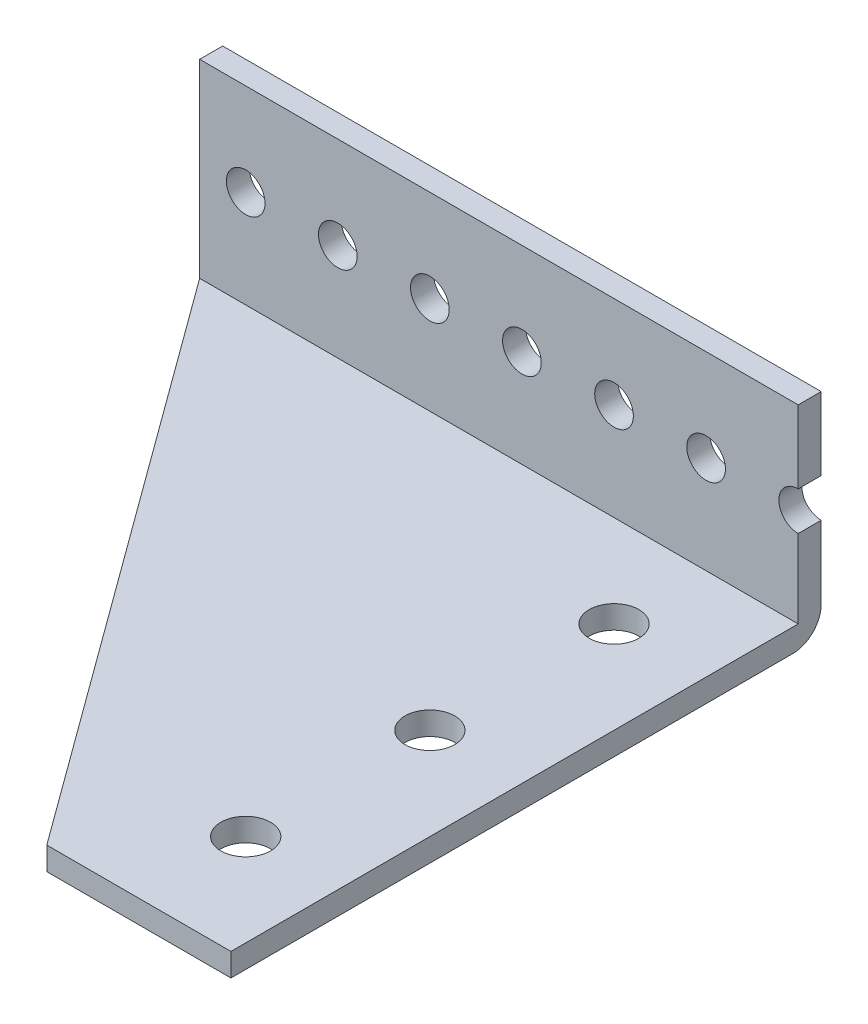
ISO-10303-21;
HEADER;
FILE_DESCRIPTION(('STEP AP214'),'2;1');
FILE_NAME('part.step','',(''),(''),'','','');
FILE_SCHEMA(('AUTOMOTIVE_DESIGN { 1 0 10303 214 1 1 1 1 }'));
ENDSEC;
DATA;
#1=APPLICATION_CONTEXT('core data for automotive mechanical design processes');
#2=APPLICATION_PROTOCOL_DEFINITION('international standard','automotive_design',2000,#1);
#3=PRODUCT_CONTEXT('',#1,'mechanical');
#4=PRODUCT('Part','Part','',(#3));
#5=PRODUCT_RELATED_PRODUCT_CATEGORY('part','',(#4));
#6=PRODUCT_DEFINITION_FORMATION('','',#4);
#7=PRODUCT_DEFINITION_CONTEXT('part definition',#1,'design');
#8=PRODUCT_DEFINITION('design','',#6,#7);
#9=PRODUCT_DEFINITION_SHAPE('','',#8);
#10=(LENGTH_UNIT() NAMED_UNIT(*) SI_UNIT(.MILLI.,.METRE.));
#11=(NAMED_UNIT(*) PLANE_ANGLE_UNIT() SI_UNIT($,.RADIAN.));
#12=(NAMED_UNIT(*) SI_UNIT($,.STERADIAN.) SOLID_ANGLE_UNIT());
#13=UNCERTAINTY_MEASURE_WITH_UNIT(LENGTH_MEASURE(1.E-05),#10,'distance_accuracy_value','');
#14=(GEOMETRIC_REPRESENTATION_CONTEXT(3) GLOBAL_UNCERTAINTY_ASSIGNED_CONTEXT((#13)) GLOBAL_UNIT_ASSIGNED_CONTEXT((#10,
#11,#12)) REPRESENTATION_CONTEXT('',''));
#15=CARTESIAN_POINT('',(0.,0.,0.));
#16=DIRECTION('',(0.,0.,1.));
#17=DIRECTION('',(1.,0.,0.));
#18=AXIS2_PLACEMENT_3D('',#15,#16,#17);
#19=CARTESIAN_POINT('',(41.275,-31.75,-40.7035));
#20=DIRECTION('',(0.,0.,1.));
#21=DIRECTION('',(1.,0.,0.));
#22=AXIS2_PLACEMENT_3D('',#19,#20,#21);
#23=PLANE('',#22);
#24=CARTESIAN_POINT('',(-22.225,-18.2879999999999,-40.7035));
#25=DIRECTION('',(0.,0.,-1.));
#26=DIRECTION('',(-1.,0.,0.));
#27=AXIS2_PLACEMENT_3D('',#24,#25,#26);
#28=CIRCLE('',#27,2.66699999999999);
#29=CARTESIAN_POINT('',(-24.892,-18.2879999999999,-40.7035));
#30=VERTEX_POINT('',#29);
#31=EDGE_CURVE('E259',#30,#30,#28,.T.);
#32=ORIENTED_EDGE('',*,*,#31,.F.);
#33=EDGE_LOOP('',(#32));
#34=FACE_BOUND('',#33,.T.);
#35=CARTESIAN_POINT('',(-9.52499999999998,-18.2879999999999,-40.7035));
#36=DIRECTION('',(0.,0.,-1.));
#37=DIRECTION('',(-1.,0.,0.));
#38=AXIS2_PLACEMENT_3D('',#35,#36,#37);
#39=CIRCLE('',#38,2.66699999999998);
#40=CARTESIAN_POINT('',(-12.192,-18.2879999999999,-40.7035));
#41=VERTEX_POINT('',#40);
#42=EDGE_CURVE('E166',#41,#41,#39,.T.);
#43=ORIENTED_EDGE('',*,*,#42,.F.);
#44=EDGE_LOOP('',(#43));
#45=FACE_BOUND('',#44,.T.);
#46=CARTESIAN_POINT('',(3.17500000000006,-18.2879999999999,-40.7035));
#47=DIRECTION('',(0.,0.,-1.));
#48=DIRECTION('',(-1.,0.,0.));
#49=AXIS2_PLACEMENT_3D('',#46,#47,#48);
#50=CIRCLE('',#49,2.66699999999998);
#51=CARTESIAN_POINT('',(0.508000000000076,-18.2879999999999,-40.7035));
#52=VERTEX_POINT('',#51);
#53=EDGE_CURVE('E162',#52,#52,#50,.T.);
#54=ORIENTED_EDGE('',*,*,#53,.F.);
#55=EDGE_LOOP('',(#54));
#56=FACE_BOUND('',#55,.T.);
#57=CARTESIAN_POINT('',(15.8750000000001,-18.2879999999999,-40.7035));
#58=DIRECTION('',(0.,0.,-1.));
#59=DIRECTION('',(-1.,0.,0.));
#60=AXIS2_PLACEMENT_3D('',#57,#58,#59);
#61=CIRCLE('',#60,2.66699999999998);
#62=CARTESIAN_POINT('',(13.2080000000001,-18.2879999999999,-40.7035));
#63=VERTEX_POINT('',#62);
#64=EDGE_CURVE('E158',#63,#63,#61,.T.);
#65=ORIENTED_EDGE('',*,*,#64,.F.);
#66=EDGE_LOOP('',(#65));
#67=FACE_BOUND('',#66,.T.);
#68=CARTESIAN_POINT('',(28.5750000000001,-18.2879999999999,-40.7035));
#69=DIRECTION('',(0.,0.,-1.));
#70=DIRECTION('',(-1.,0.,0.));
#71=AXIS2_PLACEMENT_3D('',#68,#69,#70);
#72=CIRCLE('',#71,2.66699999999998);
#73=CARTESIAN_POINT('',(25.9080000000001,-18.2879999999999,-40.7035));
#74=VERTEX_POINT('',#73);
#75=EDGE_CURVE('E157',#74,#74,#72,.T.);
#76=ORIENTED_EDGE('',*,*,#75,.F.);
#77=EDGE_LOOP('',(#76));
#78=FACE_BOUND('',#77,.T.);
#79=CARTESIAN_POINT('',(-34.925,-18.2879999999999,-40.7035));
#80=DIRECTION('',(0.,0.,-1.));
#81=DIRECTION('',(-1.,0.,0.));
#82=AXIS2_PLACEMENT_3D('',#79,#80,#81);
#83=CIRCLE('',#82,2.66699999999998);
#84=CARTESIAN_POINT('',(-37.592,-18.2879999999999,-40.7035));
#85=VERTEX_POINT('',#84);
#86=EDGE_CURVE('E204',#85,#85,#83,.T.);
#87=ORIENTED_EDGE('',*,*,#86,.F.);
#88=EDGE_LOOP('',(#87));
#89=FACE_BOUND('',#88,.T.);
#90=DIRECTION('',(0.,-1.,0.));
#91=VECTOR('',#90,1.);
#92=CARTESIAN_POINT('',(-41.275,-31.75,-40.7035));
#93=LINE('',#92,#91);
#94=CARTESIAN_POINT('',(-41.275,-5.58799999999996,-40.7035));
#95=VERTEX_POINT('',#94);
#96=CARTESIAN_POINT('',(-41.275,-30.988,-40.7035));
#97=VERTEX_POINT('',#96);
#98=EDGE_CURVE('E134',#95,#97,#93,.T.);
#99=ORIENTED_EDGE('',*,*,#98,.F.);
#100=DIRECTION('',(-1.,0.,0.));
#101=VECTOR('',#100,1.);
#102=CARTESIAN_POINT('',(41.275,-5.58799999999996,-40.7035));
#103=LINE('',#102,#101);
#104=CARTESIAN_POINT('',(41.275,-5.58799999999996,-40.7035));
#105=VERTEX_POINT('',#104);
#106=EDGE_CURVE('E123',#105,#95,#103,.T.);
#107=ORIENTED_EDGE('',*,*,#106,.F.);
#108=DIRECTION('',(0.,-1.,0.));
#109=VECTOR('',#108,1.);
#110=CARTESIAN_POINT('',(41.275,-31.75,-40.7035));
#111=LINE('',#110,#109);
#112=CARTESIAN_POINT('',(41.275,-15.621,-40.7035));
#113=VERTEX_POINT('',#112);
#114=EDGE_CURVE('E131',#105,#113,#111,.T.);
#115=ORIENTED_EDGE('',*,*,#114,.T.);
#116=CARTESIAN_POINT('',(41.275,-18.2879999999999,-40.7035));
#117=DIRECTION('',(0.,0.,-1.));
#118=DIRECTION('',(-1.,0.,0.));
#119=AXIS2_PLACEMENT_3D('',#116,#117,#118);
#120=CIRCLE('',#119,2.66699999999998);
#121=CARTESIAN_POINT('',(41.275,-20.9549999999999,-40.7035));
#122=VERTEX_POINT('',#121);
#123=EDGE_CURVE('E195',#122,#113,#120,.T.);
#124=ORIENTED_EDGE('',*,*,#123,.F.);
#125=CARTESIAN_POINT('',(41.275,-30.988,-40.7035));
#126=VERTEX_POINT('',#125);
#127=EDGE_CURVE('E141',#122,#126,#111,.T.);
#128=ORIENTED_EDGE('',*,*,#127,.T.);
#129=DIRECTION('',(-1.,0.,0.));
#130=VECTOR('',#129,1.);
#131=CARTESIAN_POINT('',(41.275,-30.988,-40.7035));
#132=LINE('',#131,#130);
#133=EDGE_CURVE('E153',#126,#97,#132,.T.);
#134=ORIENTED_EDGE('',*,*,#133,.T.);
#135=EDGE_LOOP('',(#99,#107,#115,#124,#128,#134));
#136=FACE_BOUND('',#135,.T.);
#137=ADVANCED_FACE('F48',(#34,#45,#56,#67,#78,#89,#136),#23,.F.);
#138=CARTESIAN_POINT('',(41.275,-31.75,40.7035));
#139=DIRECTION('',(-1.,0.,0.));
#140=DIRECTION('',(0.,0.,1.));
#141=AXIS2_PLACEMENT_3D('',#138,#139,#140);
#142=PLANE('',#141);
#143=ORIENTED_EDGE('',*,*,#114,.F.);
#144=DIRECTION('',(0.,0.,-1.));
#145=VECTOR('',#144,1.);
#146=CARTESIAN_POINT('',(41.275,-5.58799999999996,40.7035));
#147=LINE('',#146,#145);
#148=CARTESIAN_POINT('',(41.275,-5.58799999999996,-37.5284999999999));
#149=VERTEX_POINT('',#148);
#150=EDGE_CURVE('E120',#149,#105,#147,.T.);
#151=ORIENTED_EDGE('',*,*,#150,.F.);
#152=DIRECTION('',(0.,-1.,0.));
#153=VECTOR('',#152,1.);
#154=CARTESIAN_POINT('',(41.275,19.05,-37.5284999999999));
#155=LINE('',#154,#153);
#156=CARTESIAN_POINT('',(41.275,-15.621,-37.5284999999999));
#157=VERTEX_POINT('',#156);
#158=EDGE_CURVE('E211',#149,#157,#155,.T.);
#159=ORIENTED_EDGE('',*,*,#158,.T.);
#160=DIRECTION('',(0.,0.,-1.));
#161=VECTOR('',#160,1.);
#162=CARTESIAN_POINT('',(41.275,-15.621,-40.7035));
#163=LINE('',#162,#161);
#164=EDGE_CURVE('E139',#157,#113,#163,.T.);
#165=ORIENTED_EDGE('',*,*,#164,.T.);
#166=EDGE_LOOP('',(#143,#151,#159,#165));
#167=FACE_BOUND('',#166,.T.);
#168=ADVANCED_FACE('F137',(#167),#142,.F.);
#169=CARTESIAN_POINT('',(-41.275,-31.75,40.7035));
#170=DIRECTION('',(0.,0.,-1.));
#171=DIRECTION('',(-1.,0.,0.));
#172=AXIS2_PLACEMENT_3D('',#169,#170,#171);
#173=PLANE('',#172);
#174=DIRECTION('',(1.,0.,0.));
#175=VECTOR('',#174,1.);
#176=CARTESIAN_POINT('',(-41.275,-31.75,40.7035));
#177=LINE('',#176,#175);
#178=CARTESIAN_POINT('',(15.875,-31.75,40.7035));
#179=VERTEX_POINT('',#178);
#180=CARTESIAN_POINT('',(41.275,-31.75,40.7035));
#181=VERTEX_POINT('',#180);
#182=EDGE_CURVE('E215',#179,#181,#177,.T.);
#183=ORIENTED_EDGE('',*,*,#182,.F.);
#184=DIRECTION('',(0.,-1.,0.));
#185=VECTOR('',#184,1.);
#186=CARTESIAN_POINT('',(15.875,19.05,40.7035));
#187=LINE('',#186,#185);
#188=CARTESIAN_POINT('',(15.875,-34.925,40.7035));
#189=VERTEX_POINT('',#188);
#190=EDGE_CURVE('E224',#179,#189,#187,.T.);
#191=ORIENTED_EDGE('',*,*,#190,.T.);
#192=DIRECTION('',(1.,0.,0.));
#193=VECTOR('',#192,1.);
#194=CARTESIAN_POINT('',(-41.275,-34.925,40.7035));
#195=LINE('',#194,#193);
#196=CARTESIAN_POINT('',(41.275,-34.925,40.7035));
#197=VERTEX_POINT('',#196);
#198=EDGE_CURVE('E186',#189,#197,#195,.T.);
#199=ORIENTED_EDGE('',*,*,#198,.T.);
#200=DIRECTION('',(0.,-1.,0.));
#201=VECTOR('',#200,1.);
#202=CARTESIAN_POINT('',(41.275,-31.75,40.7035));
#203=LINE('',#202,#201);
#204=EDGE_CURVE('E140',#181,#197,#203,.T.);
#205=ORIENTED_EDGE('',*,*,#204,.F.);
#206=EDGE_LOOP('',(#183,#191,#199,#205));
#207=FACE_BOUND('',#206,.T.);
#208=ADVANCED_FACE('F223',(#207),#173,.F.);
#209=DIRECTION('',(0.,0.,-1.));
#210=VECTOR('',#209,1.);
#211=CARTESIAN_POINT('',(41.275,-34.925,40.7035));
#212=LINE('',#211,#210);
#213=CARTESIAN_POINT('',(41.275,-34.925,-36.7665));
#214=VERTEX_POINT('',#213);
#215=EDGE_CURVE('E194',#197,#214,#212,.T.);
#216=ORIENTED_EDGE('',*,*,#215,.T.);
#217=CARTESIAN_POINT('',(41.275,-30.988,-36.7665));
#218=DIRECTION('',(-1.,0.,0.));
#219=DIRECTION('',(0.,0.,1.));
#220=AXIS2_PLACEMENT_3D('',#217,#218,#219);
#221=CIRCLE('',#220,3.937);
#222=EDGE_CURVE('E173',#214,#126,#221,.F.);
#223=ORIENTED_EDGE('',*,*,#222,.T.);
#224=ORIENTED_EDGE('',*,*,#127,.F.);
#225=DIRECTION('',(0.,0.,-1.));
#226=VECTOR('',#225,1.);
#227=CARTESIAN_POINT('',(41.275,-20.9549999999999,-40.7035));
#228=LINE('',#227,#226);
#229=CARTESIAN_POINT('',(41.275,-20.9549999999999,-37.5284999999999));
#230=VERTEX_POINT('',#229);
#231=EDGE_CURVE('E144',#122,#230,#228,.F.);
#232=ORIENTED_EDGE('',*,*,#231,.T.);
#233=CARTESIAN_POINT('',(41.275,-31.75,-37.5284999999999));
#234=VERTEX_POINT('',#233);
#235=EDGE_CURVE('E210',#230,#234,#155,.T.);
#236=ORIENTED_EDGE('',*,*,#235,.T.);
#237=DIRECTION('',(0.,0.,-1.));
#238=VECTOR('',#237,1.);
#239=CARTESIAN_POINT('',(41.275,-31.75,40.7035));
#240=LINE('',#239,#238);
#241=EDGE_CURVE('E217',#181,#234,#240,.T.);
#242=ORIENTED_EDGE('',*,*,#241,.F.);
#243=ORIENTED_EDGE('',*,*,#204,.T.);
#244=EDGE_LOOP('',(#216,#223,#224,#232,#236,#242,#243));
#245=FACE_BOUND('',#244,.T.);
#246=ADVANCED_FACE('F193',(#245),#142,.F.);
#247=CARTESIAN_POINT('',(-41.275,-31.75,40.7035));
#248=DIRECTION('',(1.,0.,0.));
#249=DIRECTION('',(0.,0.,-1.));
#250=AXIS2_PLACEMENT_3D('',#247,#248,#249);
#251=PLANE('',#250);
#252=DIRECTION('',(0.,-1.,0.));
#253=VECTOR('',#252,1.);
#254=CARTESIAN_POINT('',(-41.275,19.05,-37.5284999999999));
#255=LINE('',#254,#253);
#256=CARTESIAN_POINT('',(-41.275,-5.58799999999996,-37.5284999999999));
#257=VERTEX_POINT('',#256);
#258=CARTESIAN_POINT('',(-41.275,-31.75,-37.5284999999999));
#259=VERTEX_POINT('',#258);
#260=EDGE_CURVE('E213',#257,#259,#255,.T.);
#261=ORIENTED_EDGE('',*,*,#260,.F.);
#262=DIRECTION('',(0.,0.,-1.));
#263=VECTOR('',#262,1.);
#264=CARTESIAN_POINT('',(-41.275,-5.58799999999996,40.7035));
#265=LINE('',#264,#263);
#266=EDGE_CURVE('E63',#257,#95,#265,.T.);
#267=ORIENTED_EDGE('',*,*,#266,.T.);
#268=ORIENTED_EDGE('',*,*,#98,.T.);
#269=CARTESIAN_POINT('',(-41.275,-30.988,-36.7665));
#270=DIRECTION('',(1.,0.,0.));
#271=DIRECTION('',(0.,0.,-1.));
#272=AXIS2_PLACEMENT_3D('',#269,#270,#271);
#273=CIRCLE('',#272,3.937);
#274=CARTESIAN_POINT('',(-41.275,-34.8505542067394,-37.5284999999999));
#275=VERTEX_POINT('',#274);
#276=EDGE_CURVE('E168',#97,#275,#273,.F.);
#277=ORIENTED_EDGE('',*,*,#276,.T.);
#278=DIRECTION('',(0.,-1.,0.));
#279=VECTOR('',#278,1.);
#280=CARTESIAN_POINT('',(-41.275,19.05,-37.5284999999999));
#281=LINE('',#280,#279);
#282=EDGE_CURVE('E70',#259,#275,#281,.T.);
#283=ORIENTED_EDGE('',*,*,#282,.F.);
#284=EDGE_LOOP('',(#261,#267,#268,#277,#283));
#285=FACE_BOUND('',#284,.T.);
#286=ADVANCED_FACE('F239',(#285),#251,.F.);
#287=CARTESIAN_POINT('',(0.,-31.75,0.));
#288=DIRECTION('',(0.,1.,0.));
#289=DIRECTION('',(0.,0.,1.));
#290=AXIS2_PLACEMENT_3D('',#287,#288,#289);
#291=PLANE('',#290);
#292=DIRECTION('',(-0.589885116714,0.,-0.807487181990718));
#293=VECTOR('',#292,1.);
#294=CARTESIAN_POINT('',(-9.03701688787469,-31.75,6.601716882376));
#295=LINE('',#294,#293);
#296=EDGE_CURVE('E236',#179,#259,#295,.T.);
#297=ORIENTED_EDGE('',*,*,#296,.F.);
#298=ORIENTED_EDGE('',*,*,#182,.T.);
#299=ORIENTED_EDGE('',*,*,#241,.T.);
#300=DIRECTION('',(1.,0.,0.));
#301=VECTOR('',#300,1.);
#302=CARTESIAN_POINT('',(41.275,-31.75,-37.5284999999999));
#303=LINE('',#302,#301);
#304=EDGE_CURVE('E201',#259,#234,#303,.T.);
#305=ORIENTED_EDGE('',*,*,#304,.F.);
#306=EDGE_LOOP('',(#297,#298,#299,#305));
#307=FACE_BOUND('',#306,.T.);
#308=CARTESIAN_POINT('',(28.575,-31.75,-24.8284999999999));
#309=DIRECTION('',(0.,1.,0.));
#310=DIRECTION('',(0.,0.,1.));
#311=AXIS2_PLACEMENT_3D('',#308,#309,#310);
#312=CIRCLE('',#311,3.42899999999998);
#313=CARTESIAN_POINT('',(28.575,-31.75,-21.3994999999999));
#314=VERTEX_POINT('',#313);
#315=EDGE_CURVE('E256',#314,#314,#312,.T.);
#316=ORIENTED_EDGE('',*,*,#315,.F.);
#317=EDGE_LOOP('',(#316));
#318=FACE_BOUND('',#317,.T.);
#319=CARTESIAN_POINT('',(28.5749999999997,-31.75,0.571500000000131));
#320=DIRECTION('',(0.,1.,0.));
#321=DIRECTION('',(0.,0.,1.));
#322=AXIS2_PLACEMENT_3D('',#319,#320,#321);
#323=CIRCLE('',#322,3.42899999999998);
#324=CARTESIAN_POINT('',(28.5749999999997,-31.75,4.00050000000011));
#325=VERTEX_POINT('',#324);
#326=EDGE_CURVE('E253',#325,#325,#323,.T.);
#327=ORIENTED_EDGE('',*,*,#326,.F.);
#328=EDGE_LOOP('',(#327));
#329=FACE_BOUND('',#328,.T.);
#330=CARTESIAN_POINT('',(28.5749999999995,-31.75,25.9715000000001));
#331=DIRECTION('',(0.,1.,0.));
#332=DIRECTION('',(0.,0.,1.));
#333=AXIS2_PLACEMENT_3D('',#330,#331,#332);
#334=CIRCLE('',#333,3.42899999999998);
#335=CARTESIAN_POINT('',(28.5749999999995,-31.75,29.4005000000001));
#336=VERTEX_POINT('',#335);
#337=EDGE_CURVE('E237',#336,#336,#334,.T.);
#338=ORIENTED_EDGE('',*,*,#337,.F.);
#339=EDGE_LOOP('',(#338));
#340=FACE_BOUND('',#339,.T.);
#341=ADVANCED_FACE('F230',(#307,#318,#329,#340),#291,.T.);
#342=CARTESIAN_POINT('',(0.,-34.925,0.));
#343=DIRECTION('',(0.,1.,0.));
#344=DIRECTION('',(0.,0.,1.));
#345=AXIS2_PLACEMENT_3D('',#342,#343,#344);
#346=PLANE('',#345);
#347=CARTESIAN_POINT('',(28.575,-34.925,-24.8284999999999));
#348=DIRECTION('',(0.,-1.,0.));
#349=DIRECTION('',(0.,0.,-1.));
#350=AXIS2_PLACEMENT_3D('',#347,#348,#349);
#351=CIRCLE('',#350,3.42899999999998);
#352=CARTESIAN_POINT('',(28.575,-34.925,-28.2574999999998));
#353=VERTEX_POINT('',#352);
#354=EDGE_CURVE('E187',#353,#353,#351,.T.);
#355=ORIENTED_EDGE('',*,*,#354,.F.);
#356=EDGE_LOOP('',(#355));
#357=FACE_BOUND('',#356,.T.);
#358=CARTESIAN_POINT('',(28.5749999999997,-34.925,0.571500000000131));
#359=DIRECTION('',(0.,-1.,0.));
#360=DIRECTION('',(0.,0.,-1.));
#361=AXIS2_PLACEMENT_3D('',#358,#359,#360);
#362=CIRCLE('',#361,3.42899999999998);
#363=CARTESIAN_POINT('',(28.5749999999997,-34.925,-2.85749999999985));
#364=VERTEX_POINT('',#363);
#365=EDGE_CURVE('E245',#364,#364,#362,.T.);
#366=ORIENTED_EDGE('',*,*,#365,.F.);
#367=EDGE_LOOP('',(#366));
#368=FACE_BOUND('',#367,.T.);
#369=CARTESIAN_POINT('',(28.5749999999995,-34.925,25.9715000000001));
#370=DIRECTION('',(0.,-1.,0.));
#371=DIRECTION('',(0.,0.,-1.));
#372=AXIS2_PLACEMENT_3D('',#369,#370,#371);
#373=CIRCLE('',#372,3.42899999999998);
#374=CARTESIAN_POINT('',(28.5749999999995,-34.925,22.5425000000001));
#375=VERTEX_POINT('',#374);
#376=EDGE_CURVE('E248',#375,#375,#373,.T.);
#377=ORIENTED_EDGE('',*,*,#376,.F.);
#378=EDGE_LOOP('',(#377));
#379=FACE_BOUND('',#378,.T.);
#380=ORIENTED_EDGE('',*,*,#198,.F.);
#381=DIRECTION('',(0.589885116714,0.,0.807487181990718));
#382=VECTOR('',#381,1.);
#383=CARTESIAN_POINT('',(-41.275,-34.925,-37.5284999999999));
#384=LINE('',#383,#382);
#385=CARTESIAN_POINT('',(-40.7183441558442,-34.925,-36.7665));
#386=VERTEX_POINT('',#385);
#387=EDGE_CURVE('E176',#386,#189,#384,.T.);
#388=ORIENTED_EDGE('',*,*,#387,.F.);
#389=DIRECTION('',(-1.,0.,0.));
#390=VECTOR('',#389,1.);
#391=CARTESIAN_POINT('',(0.,-34.925,-36.7665));
#392=LINE('',#391,#390);
#393=EDGE_CURVE('E171',#386,#214,#392,.F.);
#394=ORIENTED_EDGE('',*,*,#393,.T.);
#395=ORIENTED_EDGE('',*,*,#215,.F.);
#396=EDGE_LOOP('',(#380,#388,#394,#395));
#397=FACE_BOUND('',#396,.T.);
#398=ADVANCED_FACE('F183',(#357,#368,#379,#397),#346,.F.);
#399=CARTESIAN_POINT('',(41.275,19.05,-37.5284999999999));
#400=DIRECTION('',(0.,0.,-1.));
#401=DIRECTION('',(-1.,0.,0.));
#402=AXIS2_PLACEMENT_3D('',#399,#400,#401);
#403=PLANE('',#402);
#404=CARTESIAN_POINT('',(-22.225,-18.2879999999999,-37.5284999999999));
#405=DIRECTION('',(0.,0.,-1.));
#406=DIRECTION('',(-1.,0.,0.));
#407=AXIS2_PLACEMENT_3D('',#404,#405,#406);
#408=CIRCLE('',#407,2.66699999999998);
#409=CARTESIAN_POINT('',(-24.892,-18.2879999999999,-37.5284999999999));
#410=VERTEX_POINT('',#409);
#411=EDGE_CURVE('E262',#410,#410,#408,.T.);
#412=ORIENTED_EDGE('',*,*,#411,.T.);
#413=EDGE_LOOP('',(#412));
#414=FACE_BOUND('',#413,.T.);
#415=CARTESIAN_POINT('',(-9.52499999999998,-18.2879999999999,-37.5284999999999));
#416=DIRECTION('',(0.,0.,-1.));
#417=DIRECTION('',(-1.,0.,0.));
#418=AXIS2_PLACEMENT_3D('',#415,#416,#417);
#419=CIRCLE('',#418,2.66699999999998);
#420=CARTESIAN_POINT('',(-12.192,-18.2879999999999,-37.5284999999999));
#421=VERTEX_POINT('',#420);
#422=EDGE_CURVE('E163',#421,#421,#419,.T.);
#423=ORIENTED_EDGE('',*,*,#422,.T.);
#424=EDGE_LOOP('',(#423));
#425=FACE_BOUND('',#424,.T.);
#426=CARTESIAN_POINT('',(3.17500000000006,-18.2879999999999,-37.5284999999999));
#427=DIRECTION('',(0.,0.,-1.));
#428=DIRECTION('',(-1.,0.,0.));
#429=AXIS2_PLACEMENT_3D('',#426,#427,#428);
#430=CIRCLE('',#429,2.66699999999998);
#431=CARTESIAN_POINT('',(0.50800000000008,-18.2879999999999,-37.5284999999999));
#432=VERTEX_POINT('',#431);
#433=EDGE_CURVE('E159',#432,#432,#430,.T.);
#434=ORIENTED_EDGE('',*,*,#433,.T.);
#435=EDGE_LOOP('',(#434));
#436=FACE_BOUND('',#435,.T.);
#437=CARTESIAN_POINT('',(15.8750000000001,-18.2879999999999,-37.5284999999999));
#438=DIRECTION('',(0.,0.,-1.));
#439=DIRECTION('',(-1.,0.,0.));
#440=AXIS2_PLACEMENT_3D('',#437,#438,#439);
#441=CIRCLE('',#440,2.66699999999998);
#442=CARTESIAN_POINT('',(13.2080000000001,-18.2879999999999,-37.5284999999999));
#443=VERTEX_POINT('',#442);
#444=EDGE_CURVE('E154',#443,#443,#441,.T.);
#445=ORIENTED_EDGE('',*,*,#444,.T.);
#446=EDGE_LOOP('',(#445));
#447=FACE_BOUND('',#446,.T.);
#448=CARTESIAN_POINT('',(28.5750000000001,-18.2879999999999,-37.5284999999999));
#449=DIRECTION('',(0.,0.,-1.));
#450=DIRECTION('',(-1.,0.,0.));
#451=AXIS2_PLACEMENT_3D('',#448,#449,#450);
#452=CIRCLE('',#451,2.66699999999998);
#453=CARTESIAN_POINT('',(25.9080000000001,-18.2879999999999,-37.5284999999999));
#454=VERTEX_POINT('',#453);
#455=EDGE_CURVE('E273',#454,#454,#452,.T.);
#456=ORIENTED_EDGE('',*,*,#455,.T.);
#457=EDGE_LOOP('',(#456));
#458=FACE_BOUND('',#457,.T.);
#459=CARTESIAN_POINT('',(-34.925,-18.2879999999999,-37.5284999999999));
#460=DIRECTION('',(0.,0.,-1.));
#461=DIRECTION('',(-1.,0.,0.));
#462=AXIS2_PLACEMENT_3D('',#459,#460,#461);
#463=CIRCLE('',#462,2.66699999999998);
#464=CARTESIAN_POINT('',(-37.592,-18.2879999999999,-37.5284999999999));
#465=VERTEX_POINT('',#464);
#466=EDGE_CURVE('E198',#465,#465,#463,.T.);
#467=ORIENTED_EDGE('',*,*,#466,.T.);
#468=EDGE_LOOP('',(#467));
#469=FACE_BOUND('',#468,.T.);
#470=ORIENTED_EDGE('',*,*,#158,.F.);
#471=DIRECTION('',(-1.,0.,0.));
#472=VECTOR('',#471,1.);
#473=CARTESIAN_POINT('',(41.275,-5.58799999999996,-37.5284999999999));
#474=LINE('',#473,#472);
#475=EDGE_CURVE('E12',#149,#257,#474,.T.);
#476=ORIENTED_EDGE('',*,*,#475,.T.);
#477=ORIENTED_EDGE('',*,*,#260,.T.);
#478=ORIENTED_EDGE('',*,*,#304,.T.);
#479=ORIENTED_EDGE('',*,*,#235,.F.);
#480=CARTESIAN_POINT('',(41.275,-18.2879999999999,-37.5284999999999));
#481=DIRECTION('',(0.,0.,-1.));
#482=DIRECTION('',(-1.,0.,0.));
#483=AXIS2_PLACEMENT_3D('',#480,#481,#482);
#484=CIRCLE('',#483,2.66699999999998);
#485=EDGE_CURVE('E197',#230,#157,#484,.T.);
#486=ORIENTED_EDGE('',*,*,#485,.T.);
#487=EDGE_LOOP('',(#470,#476,#477,#478,#479,#486));
#488=FACE_BOUND('',#487,.T.);
#489=ADVANCED_FACE('F233',(#414,#425,#436,#447,#458,#469,#488),#403,.F.);
#490=CARTESIAN_POINT('',(41.275,-18.2879999999999,-40.7035));
#491=DIRECTION('',(0.,0.,-1.));
#492=DIRECTION('',(-1.,0.,0.));
#493=AXIS2_PLACEMENT_3D('',#490,#491,#492);
#494=CYLINDRICAL_SURFACE('',#493,2.66699999999998);
#495=ORIENTED_EDGE('',*,*,#485,.F.);
#496=ORIENTED_EDGE('',*,*,#231,.F.);
#497=ORIENTED_EDGE('',*,*,#123,.T.);
#498=ORIENTED_EDGE('',*,*,#164,.F.);
#499=EDGE_LOOP('',(#495,#496,#497,#498));
#500=FACE_BOUND('',#499,.T.);
#501=ADVANCED_FACE('F327',(#500),#494,.F.);
#502=CARTESIAN_POINT('',(-34.925,-18.2879999999999,-40.7035));
#503=DIRECTION('',(0.,0.,-1.));
#504=DIRECTION('',(-1.,0.,0.));
#505=AXIS2_PLACEMENT_3D('',#502,#503,#504);
#506=CYLINDRICAL_SURFACE('',#505,2.66699999999998);
#507=ORIENTED_EDGE('',*,*,#86,.T.);
#508=EDGE_LOOP('',(#507));
#509=FACE_BOUND('',#508,.T.);
#510=ORIENTED_EDGE('',*,*,#466,.F.);
#511=EDGE_LOOP('',(#510));
#512=FACE_BOUND('',#511,.T.);
#513=ADVANCED_FACE('F278',(#509,#512),#506,.F.);
#514=CARTESIAN_POINT('',(28.5750000000001,-18.2879999999999,-40.7035));
#515=DIRECTION('',(0.,0.,-1.));
#516=DIRECTION('',(-1.,0.,0.));
#517=AXIS2_PLACEMENT_3D('',#514,#515,#516);
#518=CYLINDRICAL_SURFACE('',#517,2.66699999999998);
#519=ORIENTED_EDGE('',*,*,#75,.T.);
#520=EDGE_LOOP('',(#519));
#521=FACE_BOUND('',#520,.T.);
#522=ORIENTED_EDGE('',*,*,#455,.F.);
#523=EDGE_LOOP('',(#522));
#524=FACE_BOUND('',#523,.T.);
#525=ADVANCED_FACE('F342',(#521,#524),#518,.F.);
#526=CARTESIAN_POINT('',(15.8750000000001,-18.2879999999999,-40.7035));
#527=DIRECTION('',(0.,0.,-1.));
#528=DIRECTION('',(-1.,0.,0.));
#529=AXIS2_PLACEMENT_3D('',#526,#527,#528);
#530=CYLINDRICAL_SURFACE('',#529,2.66699999999998);
#531=ORIENTED_EDGE('',*,*,#64,.T.);
#532=EDGE_LOOP('',(#531));
#533=FACE_BOUND('',#532,.T.);
#534=ORIENTED_EDGE('',*,*,#444,.F.);
#535=EDGE_LOOP('',(#534));
#536=FACE_BOUND('',#535,.T.);
#537=ADVANCED_FACE('F349',(#533,#536),#530,.F.);
#538=CARTESIAN_POINT('',(3.17500000000006,-18.2879999999999,-40.7035));
#539=DIRECTION('',(0.,0.,-1.));
#540=DIRECTION('',(-1.,0.,0.));
#541=AXIS2_PLACEMENT_3D('',#538,#539,#540);
#542=CYLINDRICAL_SURFACE('',#541,2.66699999999998);
#543=ORIENTED_EDGE('',*,*,#53,.T.);
#544=EDGE_LOOP('',(#543));
#545=FACE_BOUND('',#544,.T.);
#546=ORIENTED_EDGE('',*,*,#433,.F.);
#547=EDGE_LOOP('',(#546));
#548=FACE_BOUND('',#547,.T.);
#549=ADVANCED_FACE('F357',(#545,#548),#542,.F.);
#550=CARTESIAN_POINT('',(-9.52499999999998,-18.2879999999999,-40.7035));
#551=DIRECTION('',(0.,0.,-1.));
#552=DIRECTION('',(-1.,0.,0.));
#553=AXIS2_PLACEMENT_3D('',#550,#551,#552);
#554=CYLINDRICAL_SURFACE('',#553,2.66699999999998);
#555=ORIENTED_EDGE('',*,*,#42,.T.);
#556=EDGE_LOOP('',(#555));
#557=FACE_BOUND('',#556,.T.);
#558=ORIENTED_EDGE('',*,*,#422,.F.);
#559=EDGE_LOOP('',(#558));
#560=FACE_BOUND('',#559,.T.);
#561=ADVANCED_FACE('F365',(#557,#560),#554,.F.);
#562=CARTESIAN_POINT('',(-22.225,-18.2879999999999,-40.7035));
#563=DIRECTION('',(0.,0.,-1.));
#564=DIRECTION('',(-1.,0.,0.));
#565=AXIS2_PLACEMENT_3D('',#562,#563,#564);
#566=CYLINDRICAL_SURFACE('',#565,2.66699999999998);
#567=ORIENTED_EDGE('',*,*,#31,.T.);
#568=EDGE_LOOP('',(#567));
#569=FACE_BOUND('',#568,.T.);
#570=ORIENTED_EDGE('',*,*,#411,.F.);
#571=EDGE_LOOP('',(#570));
#572=FACE_BOUND('',#571,.T.);
#573=ADVANCED_FACE('F373',(#569,#572),#566,.F.);
#574=CARTESIAN_POINT('',(41.275,-30.988,-36.7665));
#575=DIRECTION('',(-1.,0.,0.));
#576=DIRECTION('',(0.,0.,1.));
#577=AXIS2_PLACEMENT_3D('',#574,#575,#576);
#578=CYLINDRICAL_SURFACE('',#577,3.937);
#579=CARTESIAN_POINT('',(-40.7183441558442,-30.988,-36.7665));
#580=DIRECTION('',(0.807487181990718,0.,-0.589885116714));
#581=DIRECTION('',(-0.589885116714,0.,-0.807487181990718));
#582=AXIS2_PLACEMENT_3D('',#579,#580,#581);
#583=ELLIPSE('',#582,4.87561918976103,3.937);
#584=EDGE_CURVE('E56',#275,#386,#583,.F.);
#585=ORIENTED_EDGE('',*,*,#584,.F.);
#586=ORIENTED_EDGE('',*,*,#276,.F.);
#587=ORIENTED_EDGE('',*,*,#133,.F.);
#588=ORIENTED_EDGE('',*,*,#222,.F.);
#589=ORIENTED_EDGE('',*,*,#393,.F.);
#590=EDGE_LOOP('',(#585,#586,#587,#588,#589));
#591=FACE_BOUND('',#590,.T.);
#592=ADVANCED_FACE('F50',(#591),#578,.T.);
#593=CARTESIAN_POINT('',(-41.275,19.05,-37.5284999999999));
#594=DIRECTION('',(0.807487181990718,0.,-0.589885116714));
#595=DIRECTION('',(-0.589885116714,0.,-0.807487181990718));
#596=AXIS2_PLACEMENT_3D('',#593,#594,#595);
#597=PLANE('',#596);
#598=ORIENTED_EDGE('',*,*,#296,.T.);
#599=ORIENTED_EDGE('',*,*,#282,.T.);
#600=ORIENTED_EDGE('',*,*,#584,.T.);
#601=ORIENTED_EDGE('',*,*,#387,.T.);
#602=ORIENTED_EDGE('',*,*,#190,.F.);
#603=EDGE_LOOP('',(#598,#599,#600,#601,#602));
#604=FACE_BOUND('',#603,.T.);
#605=ADVANCED_FACE('F175',(#604),#597,.F.);
#606=CARTESIAN_POINT('',(28.5749999999995,19.05,25.9715000000001));
#607=DIRECTION('',(0.,-1.,0.));
#608=DIRECTION('',(0.,0.,-1.));
#609=AXIS2_PLACEMENT_3D('',#606,#607,#608);
#610=CYLINDRICAL_SURFACE('',#609,3.42899999999998);
#611=ORIENTED_EDGE('',*,*,#337,.T.);
#612=EDGE_LOOP('',(#611));
#613=FACE_BOUND('',#612,.T.);
#614=ORIENTED_EDGE('',*,*,#376,.T.);
#615=EDGE_LOOP('',(#614));
#616=FACE_BOUND('',#615,.T.);
#617=ADVANCED_FACE('F391',(#613,#616),#610,.F.);
#618=CARTESIAN_POINT('',(28.5749999999997,19.05,0.571500000000131));
#619=DIRECTION('',(0.,-1.,0.));
#620=DIRECTION('',(0.,0.,-1.));
#621=AXIS2_PLACEMENT_3D('',#618,#619,#620);
#622=CYLINDRICAL_SURFACE('',#621,3.42899999999998);
#623=ORIENTED_EDGE('',*,*,#326,.T.);
#624=EDGE_LOOP('',(#623));
#625=FACE_BOUND('',#624,.T.);
#626=ORIENTED_EDGE('',*,*,#365,.T.);
#627=EDGE_LOOP('',(#626));
#628=FACE_BOUND('',#627,.T.);
#629=ADVANCED_FACE('F398',(#625,#628),#622,.F.);
#630=CARTESIAN_POINT('',(28.575,19.05,-24.8284999999999));
#631=DIRECTION('',(0.,-1.,0.));
#632=DIRECTION('',(0.,0.,-1.));
#633=AXIS2_PLACEMENT_3D('',#630,#631,#632);
#634=CYLINDRICAL_SURFACE('',#633,3.42899999999998);
#635=ORIENTED_EDGE('',*,*,#315,.T.);
#636=EDGE_LOOP('',(#635));
#637=FACE_BOUND('',#636,.T.);
#638=ORIENTED_EDGE('',*,*,#354,.T.);
#639=EDGE_LOOP('',(#638));
#640=FACE_BOUND('',#639,.T.);
#641=ADVANCED_FACE('F406',(#637,#640),#634,.F.);
#642=CARTESIAN_POINT('',(41.275,-5.58799999999996,40.7035));
#643=DIRECTION('',(0.,-1.,0.));
#644=DIRECTION('',(1.,0.,0.));
#645=AXIS2_PLACEMENT_3D('',#642,#643,#644);
#646=PLANE('',#645);
#647=ORIENTED_EDGE('',*,*,#150,.T.);
#648=ORIENTED_EDGE('',*,*,#106,.T.);
#649=ORIENTED_EDGE('',*,*,#266,.F.);
#650=ORIENTED_EDGE('',*,*,#475,.F.);
#651=EDGE_LOOP('',(#647,#648,#649,#650));
#652=FACE_BOUND('',#651,.T.);
#653=ADVANCED_FACE('F122',(#652),#646,.F.);
#654=CLOSED_SHELL('',(#137,#168,#208,#246,#286,#341,#398,#489,#501,#513,#525,#537,#549,#561,
#573,#592,#605,#617,#629,#641,#653));
#655=MANIFOLD_SOLID_BREP('B2',#654);
#656=ADVANCED_BREP_SHAPE_REPRESENTATION('',(#18,#655),#14);
#657=SHAPE_DEFINITION_REPRESENTATION(#9,#656);
ENDSEC;
END-ISO-10303-21;
